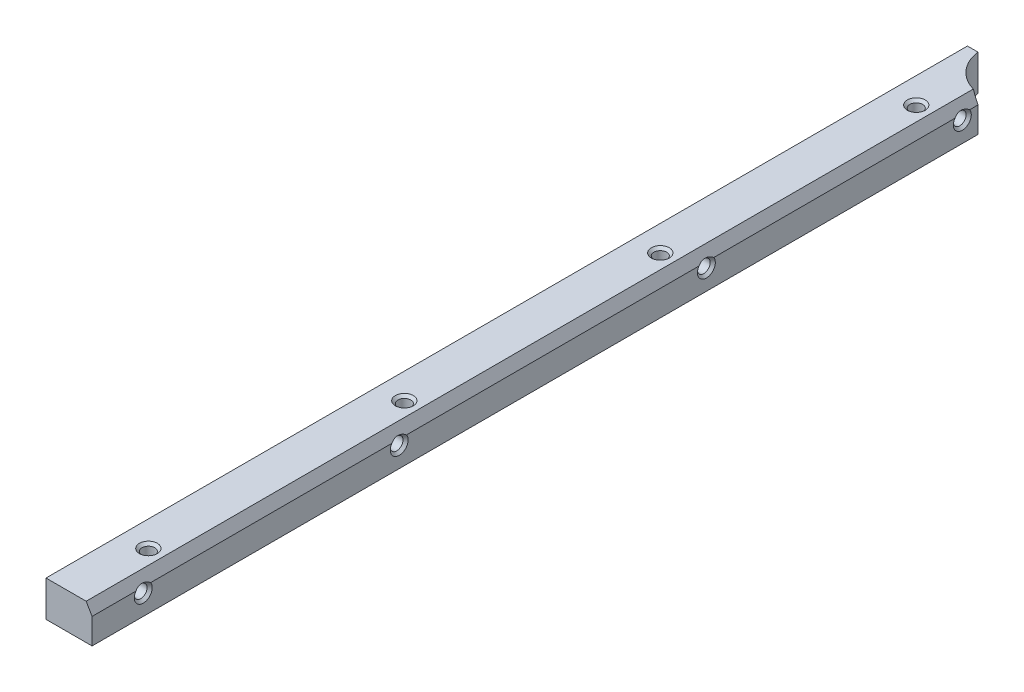
ISO-10303-21;
HEADER;
FILE_DESCRIPTION(('STEP AP214'),'2;1');
FILE_NAME('part.step','',(''),(''),'','','');
FILE_SCHEMA(('AUTOMOTIVE_DESIGN { 1 0 10303 214 1 1 1 1 }'));
ENDSEC;
DATA;
#1=APPLICATION_CONTEXT('core data for automotive mechanical design processes');
#2=APPLICATION_PROTOCOL_DEFINITION('international standard','automotive_design',2000,#1);
#3=PRODUCT_CONTEXT('',#1,'mechanical');
#4=PRODUCT('Part','Part','',(#3));
#5=PRODUCT_RELATED_PRODUCT_CATEGORY('part','',(#4));
#6=PRODUCT_DEFINITION_FORMATION('','',#4);
#7=PRODUCT_DEFINITION_CONTEXT('part definition',#1,'design');
#8=PRODUCT_DEFINITION('design','',#6,#7);
#9=PRODUCT_DEFINITION_SHAPE('','',#8);
#10=(LENGTH_UNIT() NAMED_UNIT(*) SI_UNIT(.MILLI.,.METRE.));
#11=(NAMED_UNIT(*) PLANE_ANGLE_UNIT() SI_UNIT($,.RADIAN.));
#12=(NAMED_UNIT(*) SI_UNIT($,.STERADIAN.) SOLID_ANGLE_UNIT());
#13=UNCERTAINTY_MEASURE_WITH_UNIT(LENGTH_MEASURE(1.E-05),#10,'distance_accuracy_value','');
#14=(GEOMETRIC_REPRESENTATION_CONTEXT(3) GLOBAL_UNCERTAINTY_ASSIGNED_CONTEXT((#13)) GLOBAL_UNIT_ASSIGNED_CONTEXT((#10,
#11,#12)) REPRESENTATION_CONTEXT('',''));
#15=CARTESIAN_POINT('',(0.,0.,0.));
#16=DIRECTION('',(0.,0.,1.));
#17=DIRECTION('',(1.,0.,0.));
#18=AXIS2_PLACEMENT_3D('',#15,#16,#17);
#19=CARTESIAN_POINT('',(0.,0.,180.));
#20=DIRECTION('',(1.,0.,0.));
#21=DIRECTION('',(0.,0.,-1.));
#22=AXIS2_PLACEMENT_3D('',#19,#20,#21);
#23=PLANE('',#22);
#24=CARTESIAN_POINT('',(0.,4.,10.));
#25=DIRECTION('',(-1.,0.,0.));
#26=DIRECTION('',(0.,0.,1.));
#27=AXIS2_PLACEMENT_3D('',#24,#25,#26);
#28=CIRCLE('',#27,1.75);
#29=CARTESIAN_POINT('',(0.,4.,11.75));
#30=VERTEX_POINT('',#29);
#31=EDGE_CURVE('E112',#30,#30,#28,.T.);
#32=ORIENTED_EDGE('',*,*,#31,.F.);
#33=EDGE_LOOP('',(#32));
#34=FACE_BOUND('',#33,.T.);
#35=CARTESIAN_POINT('',(0.,4.,60.));
#36=DIRECTION('',(-1.,0.,0.));
#37=DIRECTION('',(0.,0.,1.));
#38=AXIS2_PLACEMENT_3D('',#35,#36,#37);
#39=CIRCLE('',#38,1.75);
#40=CARTESIAN_POINT('',(0.,4.,61.75));
#41=VERTEX_POINT('',#40);
#42=EDGE_CURVE('E135',#41,#41,#39,.T.);
#43=ORIENTED_EDGE('',*,*,#42,.F.);
#44=EDGE_LOOP('',(#43));
#45=FACE_BOUND('',#44,.T.);
#46=CARTESIAN_POINT('',(0.,4.,120.));
#47=DIRECTION('',(-1.,0.,0.));
#48=DIRECTION('',(0.,0.,1.));
#49=AXIS2_PLACEMENT_3D('',#46,#47,#48);
#50=CIRCLE('',#49,1.75);
#51=CARTESIAN_POINT('',(0.,4.,121.75));
#52=VERTEX_POINT('',#51);
#53=EDGE_CURVE('E147',#52,#52,#50,.T.);
#54=ORIENTED_EDGE('',*,*,#53,.F.);
#55=EDGE_LOOP('',(#54));
#56=FACE_BOUND('',#55,.T.);
#57=CARTESIAN_POINT('',(0.,4.,170.));
#58=DIRECTION('',(-1.,0.,0.));
#59=DIRECTION('',(0.,0.,1.));
#60=AXIS2_PLACEMENT_3D('',#57,#58,#59);
#61=CIRCLE('',#60,1.75);
#62=CARTESIAN_POINT('',(0.,4.,171.75));
#63=VERTEX_POINT('',#62);
#64=EDGE_CURVE('E165',#63,#63,#61,.T.);
#65=ORIENTED_EDGE('',*,*,#64,.F.);
#66=EDGE_LOOP('',(#65));
#67=FACE_BOUND('',#66,.T.);
#68=DIRECTION('',(0.,-1.,0.));
#69=VECTOR('',#68,1.);
#70=CARTESIAN_POINT('',(0.,0.,0.));
#71=LINE('',#70,#69);
#72=CARTESIAN_POINT('',(0.,7.,0.));
#73=VERTEX_POINT('',#72);
#74=CARTESIAN_POINT('',(0.,0.,0.));
#75=VERTEX_POINT('',#74);
#76=EDGE_CURVE('E228',#73,#75,#71,.T.);
#77=ORIENTED_EDGE('',*,*,#76,.T.);
#78=DIRECTION('',(0.,0.,-1.));
#79=VECTOR('',#78,1.);
#80=CARTESIAN_POINT('',(0.,0.,180.));
#81=LINE('',#80,#79);
#82=CARTESIAN_POINT('',(0.,0.,180.));
#83=VERTEX_POINT('',#82);
#84=EDGE_CURVE('E252',#83,#75,#81,.T.);
#85=ORIENTED_EDGE('',*,*,#84,.F.);
#86=DIRECTION('',(0.,-1.,0.));
#87=VECTOR('',#86,1.);
#88=CARTESIAN_POINT('',(0.,0.,180.));
#89=LINE('',#88,#87);
#90=CARTESIAN_POINT('',(0.,7.,180.));
#91=VERTEX_POINT('',#90);
#92=EDGE_CURVE('E229',#91,#83,#89,.T.);
#93=ORIENTED_EDGE('',*,*,#92,.F.);
#94=DIRECTION('',(0.,0.,-1.));
#95=VECTOR('',#94,1.);
#96=CARTESIAN_POINT('',(0.,7.,180.));
#97=LINE('',#96,#95);
#98=EDGE_CURVE('E240',#91,#73,#97,.T.);
#99=ORIENTED_EDGE('',*,*,#98,.T.);
#100=EDGE_LOOP('',(#77,#85,#93,#99));
#101=FACE_BOUND('',#100,.T.);
#102=ADVANCED_FACE('F30',(#34,#45,#56,#67,#101),#23,.F.);
#103=CARTESIAN_POINT('',(0.,0.,180.));
#104=DIRECTION('',(0.,1.,0.));
#105=DIRECTION('',(0.,0.,1.));
#106=AXIS2_PLACEMENT_3D('',#103,#104,#105);
#107=PLANE('',#106);
#108=CARTESIAN_POINT('',(5.,0.,15.));
#109=DIRECTION('',(0.,-1.,0.));
#110=DIRECTION('',(0.,0.,-1.));
#111=AXIS2_PLACEMENT_3D('',#108,#109,#110);
#112=CIRCLE('',#111,1.75);
#113=CARTESIAN_POINT('',(5.,0.,13.25));
#114=VERTEX_POINT('',#113);
#115=EDGE_CURVE('E177',#114,#114,#112,.T.);
#116=ORIENTED_EDGE('',*,*,#115,.F.);
#117=EDGE_LOOP('',(#116));
#118=FACE_BOUND('',#117,.T.);
#119=CARTESIAN_POINT('',(5.,0.,65.));
#120=DIRECTION('',(0.,-1.,0.));
#121=DIRECTION('',(0.,0.,-1.));
#122=AXIS2_PLACEMENT_3D('',#119,#120,#121);
#123=CIRCLE('',#122,1.75);
#124=CARTESIAN_POINT('',(5.,0.,63.25));
#125=VERTEX_POINT('',#124);
#126=EDGE_CURVE('E189',#125,#125,#123,.T.);
#127=ORIENTED_EDGE('',*,*,#126,.F.);
#128=EDGE_LOOP('',(#127));
#129=FACE_BOUND('',#128,.T.);
#130=CARTESIAN_POINT('',(5.,0.,115.));
#131=DIRECTION('',(0.,-1.,0.));
#132=DIRECTION('',(0.,0.,-1.));
#133=AXIS2_PLACEMENT_3D('',#130,#131,#132);
#134=CIRCLE('',#133,1.75);
#135=CARTESIAN_POINT('',(5.,0.,113.25));
#136=VERTEX_POINT('',#135);
#137=EDGE_CURVE('E201',#136,#136,#134,.T.);
#138=ORIENTED_EDGE('',*,*,#137,.F.);
#139=EDGE_LOOP('',(#138));
#140=FACE_BOUND('',#139,.T.);
#141=CARTESIAN_POINT('',(5.,0.,165.));
#142=DIRECTION('',(0.,-1.,0.));
#143=DIRECTION('',(0.,0.,-1.));
#144=AXIS2_PLACEMENT_3D('',#141,#142,#143);
#145=CIRCLE('',#144,1.75);
#146=CARTESIAN_POINT('',(5.,0.,163.25));
#147=VERTEX_POINT('',#146);
#148=EDGE_CURVE('E213',#147,#147,#145,.T.);
#149=ORIENTED_EDGE('',*,*,#148,.F.);
#150=EDGE_LOOP('',(#149));
#151=FACE_BOUND('',#150,.T.);
#152=DIRECTION('',(1.,0.,0.));
#153=VECTOR('',#152,1.);
#154=CARTESIAN_POINT('',(0.,0.,0.));
#155=LINE('',#154,#153);
#156=CARTESIAN_POINT('',(2.06274606680623,0.,0.));
#157=VERTEX_POINT('',#156);
#158=EDGE_CURVE('E243',#75,#157,#155,.T.);
#159=ORIENTED_EDGE('',*,*,#158,.T.);
#160=CARTESIAN_POINT('',(10.,0.,-1.));
#161=DIRECTION('',(0.,1.,0.));
#162=DIRECTION('',(0.,0.,1.));
#163=AXIS2_PLACEMENT_3D('',#160,#161,#162);
#164=CIRCLE('',#163,8.);
#165=CARTESIAN_POINT('',(9.,0.,6.93725393319383));
#166=VERTEX_POINT('',#165);
#167=EDGE_CURVE('E226',#157,#166,#164,.T.);
#168=ORIENTED_EDGE('',*,*,#167,.T.);
#169=DIRECTION('',(0.,0.,-1.));
#170=VECTOR('',#169,1.);
#171=CARTESIAN_POINT('',(9.,0.,180.));
#172=LINE('',#171,#170);
#173=CARTESIAN_POINT('',(9.,0.,180.));
#174=VERTEX_POINT('',#173);
#175=EDGE_CURVE('E249',#174,#166,#172,.T.);
#176=ORIENTED_EDGE('',*,*,#175,.F.);
#177=DIRECTION('',(1.,0.,0.));
#178=VECTOR('',#177,1.);
#179=CARTESIAN_POINT('',(0.,0.,180.));
#180=LINE('',#179,#178);
#181=EDGE_CURVE('E232',#83,#174,#180,.T.);
#182=ORIENTED_EDGE('',*,*,#181,.F.);
#183=ORIENTED_EDGE('',*,*,#84,.T.);
#184=EDGE_LOOP('',(#159,#168,#176,#182,#183));
#185=FACE_BOUND('',#184,.T.);
#186=ADVANCED_FACE('F274',(#118,#129,#140,#151,#185),#107,.F.);
#187=CARTESIAN_POINT('',(9.,0.,180.));
#188=DIRECTION('',(-1.,0.,0.));
#189=DIRECTION('',(0.,0.,1.));
#190=AXIS2_PLACEMENT_3D('',#187,#188,#189);
#191=PLANE('',#190);
#192=DIRECTION('',(0.,0.,1.));
#193=VECTOR('',#192,1.);
#194=CARTESIAN_POINT('',(9.,5.,180.));
#195=LINE('',#194,#193);
#196=CARTESIAN_POINT('',(9.,5.,6.93725393319377));
#197=VERTEX_POINT('',#196);
#198=CARTESIAN_POINT('',(9.,5.,8.56385933836554));
#199=VERTEX_POINT('',#198);
#200=EDGE_CURVE('E111',#197,#199,#195,.T.);
#201=ORIENTED_EDGE('',*,*,#200,.T.);
#202=CARTESIAN_POINT('',(9.,4.,10.));
#203=DIRECTION('',(-1.,0.,0.));
#204=DIRECTION('',(0.,0.,1.));
#205=AXIS2_PLACEMENT_3D('',#202,#203,#204);
#206=CIRCLE('',#205,1.75);
#207=CARTESIAN_POINT('',(9.,5.,11.4361406616345));
#208=VERTEX_POINT('',#207);
#209=EDGE_CURVE('E43',#199,#208,#206,.T.);
#210=ORIENTED_EDGE('',*,*,#209,.T.);
#211=CARTESIAN_POINT('',(9.,5.,58.5638593383655));
#212=VERTEX_POINT('',#211);
#213=EDGE_CURVE('E50',#208,#212,#195,.T.);
#214=ORIENTED_EDGE('',*,*,#213,.T.);
#215=CARTESIAN_POINT('',(9.,4.,60.));
#216=DIRECTION('',(-1.,0.,0.));
#217=DIRECTION('',(0.,0.,1.));
#218=AXIS2_PLACEMENT_3D('',#215,#216,#217);
#219=CIRCLE('',#218,1.75);
#220=CARTESIAN_POINT('',(9.,5.,61.4361406616345));
#221=VERTEX_POINT('',#220);
#222=EDGE_CURVE('E132',#212,#221,#219,.T.);
#223=ORIENTED_EDGE('',*,*,#222,.T.);
#224=CARTESIAN_POINT('',(9.,5.,118.563859338366));
#225=VERTEX_POINT('',#224);
#226=EDGE_CURVE('E116',#221,#225,#195,.T.);
#227=ORIENTED_EDGE('',*,*,#226,.T.);
#228=CARTESIAN_POINT('',(9.,4.,120.));
#229=DIRECTION('',(-1.,0.,0.));
#230=DIRECTION('',(0.,0.,1.));
#231=AXIS2_PLACEMENT_3D('',#228,#229,#230);
#232=CIRCLE('',#231,1.75);
#233=CARTESIAN_POINT('',(9.,5.,121.436140661635));
#234=VERTEX_POINT('',#233);
#235=EDGE_CURVE('E144',#225,#234,#232,.T.);
#236=ORIENTED_EDGE('',*,*,#235,.T.);
#237=CARTESIAN_POINT('',(9.,5.,168.563859338366));
#238=VERTEX_POINT('',#237);
#239=EDGE_CURVE('E120',#234,#238,#195,.T.);
#240=ORIENTED_EDGE('',*,*,#239,.T.);
#241=CARTESIAN_POINT('',(9.,4.,170.));
#242=DIRECTION('',(-1.,0.,0.));
#243=DIRECTION('',(0.,0.,1.));
#244=AXIS2_PLACEMENT_3D('',#241,#242,#243);
#245=CIRCLE('',#244,1.75);
#246=CARTESIAN_POINT('',(9.,5.,171.436140661635));
#247=VERTEX_POINT('',#246);
#248=EDGE_CURVE('E163',#238,#247,#245,.T.);
#249=ORIENTED_EDGE('',*,*,#248,.T.);
#250=CARTESIAN_POINT('',(9.,4.99999999999999,180.));
#251=VERTEX_POINT('',#250);
#252=EDGE_CURVE('E119',#247,#251,#195,.T.);
#253=ORIENTED_EDGE('',*,*,#252,.T.);
#254=DIRECTION('',(0.,1.,0.));
#255=VECTOR('',#254,1.);
#256=CARTESIAN_POINT('',(9.,0.,180.));
#257=LINE('',#256,#255);
#258=EDGE_CURVE('E235',#174,#251,#257,.T.);
#259=ORIENTED_EDGE('',*,*,#258,.F.);
#260=ORIENTED_EDGE('',*,*,#175,.T.);
#261=DIRECTION('',(0.,1.,0.));
#262=VECTOR('',#261,1.);
#263=CARTESIAN_POINT('',(9.,-225.450937012912,6.93725393319377));
#264=LINE('',#263,#262);
#265=EDGE_CURVE('E222',#166,#197,#264,.T.);
#266=ORIENTED_EDGE('',*,*,#265,.T.);
#267=EDGE_LOOP('',(#201,#210,#214,#223,#227,#236,#240,#249,#253,#259,#260,#266));
#268=FACE_BOUND('',#267,.T.);
#269=ADVANCED_FACE('F109',(#268),#191,.F.);
#270=CARTESIAN_POINT('',(0.,7.,180.));
#271=DIRECTION('',(0.,-1.,0.));
#272=DIRECTION('',(0.,0.,-1.));
#273=AXIS2_PLACEMENT_3D('',#270,#271,#272);
#274=PLANE('',#273);
#275=CARTESIAN_POINT('',(5.,7.,15.));
#276=DIRECTION('',(0.,-1.,0.));
#277=DIRECTION('',(0.,0.,-1.));
#278=AXIS2_PLACEMENT_3D('',#275,#276,#277);
#279=CIRCLE('',#278,1.75);
#280=CARTESIAN_POINT('',(5.,7.,13.25));
#281=VERTEX_POINT('',#280);
#282=EDGE_CURVE('E174',#281,#281,#279,.T.);
#283=ORIENTED_EDGE('',*,*,#282,.T.);
#284=EDGE_LOOP('',(#283));
#285=FACE_BOUND('',#284,.T.);
#286=CARTESIAN_POINT('',(5.,7.,65.));
#287=DIRECTION('',(0.,-1.,0.));
#288=DIRECTION('',(0.,0.,-1.));
#289=AXIS2_PLACEMENT_3D('',#286,#287,#288);
#290=CIRCLE('',#289,1.75);
#291=CARTESIAN_POINT('',(5.,7.,63.25));
#292=VERTEX_POINT('',#291);
#293=EDGE_CURVE('E186',#292,#292,#290,.T.);
#294=ORIENTED_EDGE('',*,*,#293,.T.);
#295=EDGE_LOOP('',(#294));
#296=FACE_BOUND('',#295,.T.);
#297=CARTESIAN_POINT('',(5.,7.,115.));
#298=DIRECTION('',(0.,-1.,0.));
#299=DIRECTION('',(0.,0.,-1.));
#300=AXIS2_PLACEMENT_3D('',#297,#298,#299);
#301=CIRCLE('',#300,1.75);
#302=CARTESIAN_POINT('',(5.,7.,113.25));
#303=VERTEX_POINT('',#302);
#304=EDGE_CURVE('E198',#303,#303,#301,.T.);
#305=ORIENTED_EDGE('',*,*,#304,.T.);
#306=EDGE_LOOP('',(#305));
#307=FACE_BOUND('',#306,.T.);
#308=CARTESIAN_POINT('',(5.,7.,165.));
#309=DIRECTION('',(0.,-1.,0.));
#310=DIRECTION('',(0.,0.,-1.));
#311=AXIS2_PLACEMENT_3D('',#308,#309,#310);
#312=CIRCLE('',#311,1.75);
#313=CARTESIAN_POINT('',(5.,7.,163.25));
#314=VERTEX_POINT('',#313);
#315=EDGE_CURVE('E210',#314,#314,#312,.T.);
#316=ORIENTED_EDGE('',*,*,#315,.T.);
#317=EDGE_LOOP('',(#316));
#318=FACE_BOUND('',#317,.T.);
#319=DIRECTION('',(-1.,0.,0.));
#320=VECTOR('',#319,1.);
#321=CARTESIAN_POINT('',(0.,7.,180.));
#322=LINE('',#321,#320);
#323=CARTESIAN_POINT('',(7.84529946162074,7.,180.));
#324=VERTEX_POINT('',#323);
#325=EDGE_CURVE('E238',#324,#91,#322,.T.);
#326=ORIENTED_EDGE('',*,*,#325,.F.);
#327=DIRECTION('',(0.,0.,-1.));
#328=VECTOR('',#327,1.);
#329=CARTESIAN_POINT('',(7.84529946162074,7.,180.));
#330=LINE('',#329,#328);
#331=CARTESIAN_POINT('',(7.84529946162074,7.00000000000001,6.70436665728651));
#332=VERTEX_POINT('',#331);
#333=EDGE_CURVE('E257',#324,#332,#330,.T.);
#334=ORIENTED_EDGE('',*,*,#333,.T.);
#335=CARTESIAN_POINT('',(10.,7.00000000000001,-1.));
#336=DIRECTION('',(0.,-1.,0.));
#337=DIRECTION('',(0.,0.,-1.));
#338=AXIS2_PLACEMENT_3D('',#335,#336,#337);
#339=CIRCLE('',#338,8.);
#340=CARTESIAN_POINT('',(2.06274606680623,7.00000000000001,0.));
#341=VERTEX_POINT('',#340);
#342=EDGE_CURVE('E224',#332,#341,#339,.T.);
#343=ORIENTED_EDGE('',*,*,#342,.T.);
#344=DIRECTION('',(-1.,0.,0.));
#345=VECTOR('',#344,1.);
#346=CARTESIAN_POINT('',(0.,7.,0.));
#347=LINE('',#346,#345);
#348=EDGE_CURVE('E233',#341,#73,#347,.T.);
#349=ORIENTED_EDGE('',*,*,#348,.T.);
#350=ORIENTED_EDGE('',*,*,#98,.F.);
#351=EDGE_LOOP('',(#326,#334,#343,#349,#350));
#352=FACE_BOUND('',#351,.T.);
#353=ADVANCED_FACE('F283',(#285,#296,#307,#318,#352),#274,.F.);
#354=CARTESIAN_POINT('',(0.,7.,180.));
#355=DIRECTION('',(0.,0.,-1.));
#356=DIRECTION('',(-1.,0.,0.));
#357=AXIS2_PLACEMENT_3D('',#354,#355,#356);
#358=PLANE('',#357);
#359=ORIENTED_EDGE('',*,*,#258,.T.);
#360=DIRECTION('',(0.500000000000001,-0.866025403784438,0.));
#361=VECTOR('',#360,1.);
#362=CARTESIAN_POINT('',(7.84529946162074,7.,180.));
#363=LINE('',#362,#361);
#364=EDGE_CURVE('E118',#251,#324,#363,.F.);
#365=ORIENTED_EDGE('',*,*,#364,.T.);
#366=ORIENTED_EDGE('',*,*,#325,.T.);
#367=ORIENTED_EDGE('',*,*,#92,.T.);
#368=ORIENTED_EDGE('',*,*,#181,.T.);
#369=EDGE_LOOP('',(#359,#365,#366,#367,#368));
#370=FACE_BOUND('',#369,.T.);
#371=ADVANCED_FACE('F269',(#370),#358,.F.);
#372=CARTESIAN_POINT('',(0.,7.,0.));
#373=DIRECTION('',(0.,0.,-1.));
#374=DIRECTION('',(-1.,0.,0.));
#375=AXIS2_PLACEMENT_3D('',#372,#373,#374);
#376=PLANE('',#375);
#377=DIRECTION('',(0.,1.,0.));
#378=VECTOR('',#377,1.);
#379=CARTESIAN_POINT('',(2.06274606680623,-225.450937012912,0.));
#380=LINE('',#379,#378);
#381=EDGE_CURVE('E255',#157,#341,#380,.T.);
#382=ORIENTED_EDGE('',*,*,#381,.F.);
#383=ORIENTED_EDGE('',*,*,#158,.F.);
#384=ORIENTED_EDGE('',*,*,#76,.F.);
#385=ORIENTED_EDGE('',*,*,#348,.F.);
#386=EDGE_LOOP('',(#382,#383,#384,#385));
#387=FACE_BOUND('',#386,.T.);
#388=ADVANCED_FACE('F279',(#387),#376,.T.);
#389=CARTESIAN_POINT('',(10.,-225.450937012912,-1.));
#390=DIRECTION('',(0.,1.,0.));
#391=DIRECTION('',(0.,0.,1.));
#392=AXIS2_PLACEMENT_3D('',#389,#390,#391);
#393=CYLINDRICAL_SURFACE('',#392,8.);
#394=ORIENTED_EDGE('',*,*,#342,.F.);
#395=CARTESIAN_POINT('',(10.,3.26794919243112,-1.));
#396=DIRECTION('',(-0.866025403784438,-0.5,0.));
#397=DIRECTION('',(-0.500000000000001,0.866025403784438,0.));
#398=AXIS2_PLACEMENT_3D('',#395,#396,#397);
#399=ELLIPSE('',#398,16.,8.);
#400=EDGE_CURVE('E123',#332,#197,#399,.F.);
#401=ORIENTED_EDGE('',*,*,#400,.T.);
#402=ORIENTED_EDGE('',*,*,#265,.F.);
#403=ORIENTED_EDGE('',*,*,#167,.F.);
#404=ORIENTED_EDGE('',*,*,#381,.T.);
#405=EDGE_LOOP('',(#394,#401,#402,#403,#404));
#406=FACE_BOUND('',#405,.T.);
#407=ADVANCED_FACE('F276',(#406),#393,.F.);
#408=CARTESIAN_POINT('',(7.84529946162074,7.,180.));
#409=DIRECTION('',(-0.866025403784438,-0.5,0.));
#410=DIRECTION('',(0.500000000000001,-0.866025403784438,0.));
#411=AXIS2_PLACEMENT_3D('',#408,#409,#410);
#412=PLANE('',#411);
#413=CARTESIAN_POINT('',(10.7410254037844,1.98445554337723,10.));
#414=DIRECTION('',(-0.866025403784438,-0.5,0.));
#415=DIRECTION('',(0.5,-0.866025403784438,0.));
#416=AXIS2_PLACEMENT_3D('',#413,#414,#415);
#417=ELLIPSE('',#416,4.03108891324553,2.85041030612183);
#418=EDGE_CURVE('E11',#199,#208,#417,.F.);
#419=ORIENTED_EDGE('',*,*,#418,.F.);
#420=ORIENTED_EDGE('',*,*,#200,.F.);
#421=ORIENTED_EDGE('',*,*,#400,.F.);
#422=ORIENTED_EDGE('',*,*,#333,.F.);
#423=ORIENTED_EDGE('',*,*,#364,.F.);
#424=ORIENTED_EDGE('',*,*,#252,.F.);
#425=CARTESIAN_POINT('',(10.7410254037844,1.98445554337723,170.));
#426=DIRECTION('',(-0.866025403784438,-0.5,0.));
#427=DIRECTION('',(0.5,-0.866025403784438,0.));
#428=AXIS2_PLACEMENT_3D('',#425,#426,#427);
#429=ELLIPSE('',#428,4.03108891324553,2.85041030612183);
#430=EDGE_CURVE('E126',#238,#247,#429,.F.);
#431=ORIENTED_EDGE('',*,*,#430,.F.);
#432=ORIENTED_EDGE('',*,*,#239,.F.);
#433=CARTESIAN_POINT('',(10.7410254037844,1.98445554337723,120.));
#434=DIRECTION('',(-0.866025403784438,-0.5,0.));
#435=DIRECTION('',(0.5,-0.866025403784438,0.));
#436=AXIS2_PLACEMENT_3D('',#433,#434,#435);
#437=ELLIPSE('',#436,4.03108891324553,2.85041030612183);
#438=EDGE_CURVE('E128',#225,#234,#437,.F.);
#439=ORIENTED_EDGE('',*,*,#438,.F.);
#440=ORIENTED_EDGE('',*,*,#226,.F.);
#441=CARTESIAN_POINT('',(10.7410254037844,1.98445554337723,60.));
#442=DIRECTION('',(-0.866025403784438,-0.5,0.));
#443=DIRECTION('',(0.5,-0.866025403784438,0.));
#444=AXIS2_PLACEMENT_3D('',#441,#442,#443);
#445=ELLIPSE('',#444,4.03108891324553,2.85041030612183);
#446=EDGE_CURVE('E38',#212,#221,#445,.F.);
#447=ORIENTED_EDGE('',*,*,#446,.F.);
#448=ORIENTED_EDGE('',*,*,#213,.F.);
#449=EDGE_LOOP('',(#419,#420,#421,#422,#423,#424,#431,#432,#439,#440,#447,#448));
#450=FACE_BOUND('',#449,.T.);
#451=ADVANCED_FACE('F32',(#450),#412,.F.);
#452=CARTESIAN_POINT('',(5.,6.5,165.));
#453=DIRECTION('',(0.,1.,0.));
#454=DIRECTION('',(0.,0.,1.));
#455=AXIS2_PLACEMENT_3D('',#452,#453,#454);
#456=CONICAL_SURFACE('',#455,1.25,0.785398163397448);
#457=ORIENTED_EDGE('',*,*,#315,.F.);
#458=EDGE_LOOP('',(#457));
#459=FACE_BOUND('',#458,.T.);
#460=CARTESIAN_POINT('',(5.,6.5,165.));
#461=DIRECTION('',(0.,-1.,0.));
#462=DIRECTION('',(0.,0.,-1.));
#463=AXIS2_PLACEMENT_3D('',#460,#461,#462);
#464=CIRCLE('',#463,1.25);
#465=CARTESIAN_POINT('',(5.,6.5,163.75));
#466=VERTEX_POINT('',#465);
#467=EDGE_CURVE('E219',#466,#466,#464,.T.);
#468=ORIENTED_EDGE('',*,*,#467,.T.);
#469=EDGE_LOOP('',(#468));
#470=FACE_BOUND('',#469,.T.);
#471=ADVANCED_FACE('F375',(#459,#470),#456,.F.);
#472=CARTESIAN_POINT('',(5.,0.,165.));
#473=DIRECTION('',(0.,-1.,0.));
#474=DIRECTION('',(0.,0.,-1.));
#475=AXIS2_PLACEMENT_3D('',#472,#473,#474);
#476=CYLINDRICAL_SURFACE('',#475,1.24999999999999);
#477=ORIENTED_EDGE('',*,*,#467,.F.);
#478=EDGE_LOOP('',(#477));
#479=FACE_BOUND('',#478,.T.);
#480=CARTESIAN_POINT('',(5.,0.500000000000028,165.));
#481=DIRECTION('',(0.,-1.,0.));
#482=DIRECTION('',(0.,0.,-1.));
#483=AXIS2_PLACEMENT_3D('',#480,#481,#482);
#484=CIRCLE('',#483,1.24999999999999);
#485=CARTESIAN_POINT('',(5.,0.500000000000028,163.75));
#486=VERTEX_POINT('',#485);
#487=EDGE_CURVE('E216',#486,#486,#484,.T.);
#488=ORIENTED_EDGE('',*,*,#487,.T.);
#489=EDGE_LOOP('',(#488));
#490=FACE_BOUND('',#489,.T.);
#491=ADVANCED_FACE('F371',(#479,#490),#476,.F.);
#492=CARTESIAN_POINT('',(5.,0.,165.));
#493=DIRECTION('',(0.,-1.,0.));
#494=DIRECTION('',(0.,0.,-1.));
#495=AXIS2_PLACEMENT_3D('',#492,#493,#494);
#496=CONICAL_SURFACE('',#495,1.75,0.785398163397431);
#497=ORIENTED_EDGE('',*,*,#487,.F.);
#498=EDGE_LOOP('',(#497));
#499=FACE_BOUND('',#498,.T.);
#500=ORIENTED_EDGE('',*,*,#148,.T.);
#501=EDGE_LOOP('',(#500));
#502=FACE_BOUND('',#501,.T.);
#503=ADVANCED_FACE('F367',(#499,#502),#496,.F.);
#504=CARTESIAN_POINT('',(5.,6.5,115.));
#505=DIRECTION('',(0.,1.,0.));
#506=DIRECTION('',(0.,0.,1.));
#507=AXIS2_PLACEMENT_3D('',#504,#505,#506);
#508=CONICAL_SURFACE('',#507,1.25,0.785398163397448);
#509=ORIENTED_EDGE('',*,*,#304,.F.);
#510=EDGE_LOOP('',(#509));
#511=FACE_BOUND('',#510,.T.);
#512=CARTESIAN_POINT('',(5.,6.5,115.));
#513=DIRECTION('',(0.,-1.,0.));
#514=DIRECTION('',(0.,0.,-1.));
#515=AXIS2_PLACEMENT_3D('',#512,#513,#514);
#516=CIRCLE('',#515,1.25);
#517=CARTESIAN_POINT('',(5.,6.5,113.75));
#518=VERTEX_POINT('',#517);
#519=EDGE_CURVE('E207',#518,#518,#516,.T.);
#520=ORIENTED_EDGE('',*,*,#519,.T.);
#521=EDGE_LOOP('',(#520));
#522=FACE_BOUND('',#521,.T.);
#523=ADVANCED_FACE('F363',(#511,#522),#508,.F.);
#524=CARTESIAN_POINT('',(5.,0.,115.));
#525=DIRECTION('',(0.,-1.,0.));
#526=DIRECTION('',(0.,0.,-1.));
#527=AXIS2_PLACEMENT_3D('',#524,#525,#526);
#528=CYLINDRICAL_SURFACE('',#527,1.24999999999999);
#529=ORIENTED_EDGE('',*,*,#519,.F.);
#530=EDGE_LOOP('',(#529));
#531=FACE_BOUND('',#530,.T.);
#532=CARTESIAN_POINT('',(5.,0.500000000000028,115.));
#533=DIRECTION('',(0.,-1.,0.));
#534=DIRECTION('',(0.,0.,-1.));
#535=AXIS2_PLACEMENT_3D('',#532,#533,#534);
#536=CIRCLE('',#535,1.24999999999999);
#537=CARTESIAN_POINT('',(5.,0.500000000000028,113.75));
#538=VERTEX_POINT('',#537);
#539=EDGE_CURVE('E204',#538,#538,#536,.T.);
#540=ORIENTED_EDGE('',*,*,#539,.T.);
#541=EDGE_LOOP('',(#540));
#542=FACE_BOUND('',#541,.T.);
#543=ADVANCED_FACE('F359',(#531,#542),#528,.F.);
#544=CARTESIAN_POINT('',(5.,0.,115.));
#545=DIRECTION('',(0.,-1.,0.));
#546=DIRECTION('',(0.,0.,-1.));
#547=AXIS2_PLACEMENT_3D('',#544,#545,#546);
#548=CONICAL_SURFACE('',#547,1.75,0.785398163397431);
#549=ORIENTED_EDGE('',*,*,#539,.F.);
#550=EDGE_LOOP('',(#549));
#551=FACE_BOUND('',#550,.T.);
#552=ORIENTED_EDGE('',*,*,#137,.T.);
#553=EDGE_LOOP('',(#552));
#554=FACE_BOUND('',#553,.T.);
#555=ADVANCED_FACE('F355',(#551,#554),#548,.F.);
#556=CARTESIAN_POINT('',(5.,6.5,65.));
#557=DIRECTION('',(0.,1.,0.));
#558=DIRECTION('',(0.,0.,1.));
#559=AXIS2_PLACEMENT_3D('',#556,#557,#558);
#560=CONICAL_SURFACE('',#559,1.25,0.785398163397448);
#561=ORIENTED_EDGE('',*,*,#293,.F.);
#562=EDGE_LOOP('',(#561));
#563=FACE_BOUND('',#562,.T.);
#564=CARTESIAN_POINT('',(5.,6.5,65.));
#565=DIRECTION('',(0.,-1.,0.));
#566=DIRECTION('',(0.,0.,-1.));
#567=AXIS2_PLACEMENT_3D('',#564,#565,#566);
#568=CIRCLE('',#567,1.25);
#569=CARTESIAN_POINT('',(5.,6.5,63.75));
#570=VERTEX_POINT('',#569);
#571=EDGE_CURVE('E195',#570,#570,#568,.T.);
#572=ORIENTED_EDGE('',*,*,#571,.T.);
#573=EDGE_LOOP('',(#572));
#574=FACE_BOUND('',#573,.T.);
#575=ADVANCED_FACE('F351',(#563,#574),#560,.F.);
#576=CARTESIAN_POINT('',(5.,0.,65.));
#577=DIRECTION('',(0.,-1.,0.));
#578=DIRECTION('',(0.,0.,-1.));
#579=AXIS2_PLACEMENT_3D('',#576,#577,#578);
#580=CYLINDRICAL_SURFACE('',#579,1.24999999999999);
#581=ORIENTED_EDGE('',*,*,#571,.F.);
#582=EDGE_LOOP('',(#581));
#583=FACE_BOUND('',#582,.T.);
#584=CARTESIAN_POINT('',(5.,0.500000000000028,65.));
#585=DIRECTION('',(0.,-1.,0.));
#586=DIRECTION('',(0.,0.,-1.));
#587=AXIS2_PLACEMENT_3D('',#584,#585,#586);
#588=CIRCLE('',#587,1.24999999999999);
#589=CARTESIAN_POINT('',(5.,0.500000000000028,63.75));
#590=VERTEX_POINT('',#589);
#591=EDGE_CURVE('E192',#590,#590,#588,.T.);
#592=ORIENTED_EDGE('',*,*,#591,.T.);
#593=EDGE_LOOP('',(#592));
#594=FACE_BOUND('',#593,.T.);
#595=ADVANCED_FACE('F347',(#583,#594),#580,.F.);
#596=CARTESIAN_POINT('',(5.,0.,65.));
#597=DIRECTION('',(0.,-1.,0.));
#598=DIRECTION('',(0.,0.,-1.));
#599=AXIS2_PLACEMENT_3D('',#596,#597,#598);
#600=CONICAL_SURFACE('',#599,1.75,0.785398163397431);
#601=ORIENTED_EDGE('',*,*,#591,.F.);
#602=EDGE_LOOP('',(#601));
#603=FACE_BOUND('',#602,.T.);
#604=ORIENTED_EDGE('',*,*,#126,.T.);
#605=EDGE_LOOP('',(#604));
#606=FACE_BOUND('',#605,.T.);
#607=ADVANCED_FACE('F343',(#603,#606),#600,.F.);
#608=CARTESIAN_POINT('',(5.,6.5,15.));
#609=DIRECTION('',(0.,1.,0.));
#610=DIRECTION('',(0.,0.,1.));
#611=AXIS2_PLACEMENT_3D('',#608,#609,#610);
#612=CONICAL_SURFACE('',#611,1.25,0.785398163397448);
#613=ORIENTED_EDGE('',*,*,#282,.F.);
#614=EDGE_LOOP('',(#613));
#615=FACE_BOUND('',#614,.T.);
#616=CARTESIAN_POINT('',(5.,6.5,15.));
#617=DIRECTION('',(0.,-1.,0.));
#618=DIRECTION('',(0.,0.,-1.));
#619=AXIS2_PLACEMENT_3D('',#616,#617,#618);
#620=CIRCLE('',#619,1.25);
#621=CARTESIAN_POINT('',(5.,6.5,13.75));
#622=VERTEX_POINT('',#621);
#623=EDGE_CURVE('E183',#622,#622,#620,.T.);
#624=ORIENTED_EDGE('',*,*,#623,.T.);
#625=EDGE_LOOP('',(#624));
#626=FACE_BOUND('',#625,.T.);
#627=ADVANCED_FACE('F339',(#615,#626),#612,.F.);
#628=CARTESIAN_POINT('',(5.,0.,15.));
#629=DIRECTION('',(0.,-1.,0.));
#630=DIRECTION('',(0.,0.,-1.));
#631=AXIS2_PLACEMENT_3D('',#628,#629,#630);
#632=CYLINDRICAL_SURFACE('',#631,1.24999999999999);
#633=ORIENTED_EDGE('',*,*,#623,.F.);
#634=EDGE_LOOP('',(#633));
#635=FACE_BOUND('',#634,.T.);
#636=CARTESIAN_POINT('',(5.,0.500000000000028,15.));
#637=DIRECTION('',(0.,-1.,0.));
#638=DIRECTION('',(0.,0.,-1.));
#639=AXIS2_PLACEMENT_3D('',#636,#637,#638);
#640=CIRCLE('',#639,1.24999999999999);
#641=CARTESIAN_POINT('',(5.,0.500000000000028,13.75));
#642=VERTEX_POINT('',#641);
#643=EDGE_CURVE('E180',#642,#642,#640,.T.);
#644=ORIENTED_EDGE('',*,*,#643,.T.);
#645=EDGE_LOOP('',(#644));
#646=FACE_BOUND('',#645,.T.);
#647=ADVANCED_FACE('F335',(#635,#646),#632,.F.);
#648=CARTESIAN_POINT('',(5.,0.,15.));
#649=DIRECTION('',(0.,-1.,0.));
#650=DIRECTION('',(0.,0.,-1.));
#651=AXIS2_PLACEMENT_3D('',#648,#649,#650);
#652=CONICAL_SURFACE('',#651,1.75,0.785398163397431);
#653=ORIENTED_EDGE('',*,*,#643,.F.);
#654=EDGE_LOOP('',(#653));
#655=FACE_BOUND('',#654,.T.);
#656=ORIENTED_EDGE('',*,*,#115,.T.);
#657=EDGE_LOOP('',(#656));
#658=FACE_BOUND('',#657,.T.);
#659=ADVANCED_FACE('F331',(#655,#658),#652,.F.);
#660=CARTESIAN_POINT('',(8.5,4.,170.));
#661=DIRECTION('',(1.,0.,0.));
#662=DIRECTION('',(0.,0.,-1.));
#663=AXIS2_PLACEMENT_3D('',#660,#661,#662);
#664=CONICAL_SURFACE('',#663,1.25,0.785398163397448);
#665=ORIENTED_EDGE('',*,*,#430,.T.);
#666=ORIENTED_EDGE('',*,*,#248,.F.);
#667=EDGE_LOOP('',(#665,#666));
#668=FACE_BOUND('',#667,.T.);
#669=CARTESIAN_POINT('',(8.5,4.,170.));
#670=DIRECTION('',(-1.,0.,0.));
#671=DIRECTION('',(0.,0.,1.));
#672=AXIS2_PLACEMENT_3D('',#669,#670,#671);
#673=CIRCLE('',#672,1.25);
#674=CARTESIAN_POINT('',(8.5,4.,171.25));
#675=VERTEX_POINT('',#674);
#676=EDGE_CURVE('E171',#675,#675,#673,.T.);
#677=ORIENTED_EDGE('',*,*,#676,.T.);
#678=EDGE_LOOP('',(#677));
#679=FACE_BOUND('',#678,.T.);
#680=ADVANCED_FACE('F323',(#668,#679),#664,.F.);
#681=CARTESIAN_POINT('',(0.,4.,170.));
#682=DIRECTION('',(-1.,0.,0.));
#683=DIRECTION('',(0.,0.,1.));
#684=AXIS2_PLACEMENT_3D('',#681,#682,#683);
#685=CYLINDRICAL_SURFACE('',#684,1.24999999999999);
#686=ORIENTED_EDGE('',*,*,#676,.F.);
#687=EDGE_LOOP('',(#686));
#688=FACE_BOUND('',#687,.T.);
#689=CARTESIAN_POINT('',(0.500000000000028,4.,170.));
#690=DIRECTION('',(-1.,0.,0.));
#691=DIRECTION('',(0.,0.,1.));
#692=AXIS2_PLACEMENT_3D('',#689,#690,#691);
#693=CIRCLE('',#692,1.24999999999999);
#694=CARTESIAN_POINT('',(0.500000000000028,4.,171.25));
#695=VERTEX_POINT('',#694);
#696=EDGE_CURVE('E168',#695,#695,#693,.T.);
#697=ORIENTED_EDGE('',*,*,#696,.T.);
#698=EDGE_LOOP('',(#697));
#699=FACE_BOUND('',#698,.T.);
#700=ADVANCED_FACE('F314',(#688,#699),#685,.F.);
#701=CARTESIAN_POINT('',(0.,4.,170.));
#702=DIRECTION('',(-1.,0.,0.));
#703=DIRECTION('',(0.,0.,1.));
#704=AXIS2_PLACEMENT_3D('',#701,#702,#703);
#705=CONICAL_SURFACE('',#704,1.75,0.785398163397431);
#706=ORIENTED_EDGE('',*,*,#696,.F.);
#707=EDGE_LOOP('',(#706));
#708=FACE_BOUND('',#707,.T.);
#709=ORIENTED_EDGE('',*,*,#64,.T.);
#710=EDGE_LOOP('',(#709));
#711=FACE_BOUND('',#710,.T.);
#712=ADVANCED_FACE('F312',(#708,#711),#705,.F.);
#713=CARTESIAN_POINT('',(8.5,4.,120.));
#714=DIRECTION('',(1.,0.,0.));
#715=DIRECTION('',(0.,0.,-1.));
#716=AXIS2_PLACEMENT_3D('',#713,#714,#715);
#717=CONICAL_SURFACE('',#716,1.25,0.785398163397448);
#718=ORIENTED_EDGE('',*,*,#438,.T.);
#719=ORIENTED_EDGE('',*,*,#235,.F.);
#720=EDGE_LOOP('',(#718,#719));
#721=FACE_BOUND('',#720,.T.);
#722=CARTESIAN_POINT('',(8.5,4.,120.));
#723=DIRECTION('',(-1.,0.,0.));
#724=DIRECTION('',(0.,0.,1.));
#725=AXIS2_PLACEMENT_3D('',#722,#723,#724);
#726=CIRCLE('',#725,1.25);
#727=CARTESIAN_POINT('',(8.5,4.,121.25));
#728=VERTEX_POINT('',#727);
#729=EDGE_CURVE('E160',#728,#728,#726,.T.);
#730=ORIENTED_EDGE('',*,*,#729,.T.);
#731=EDGE_LOOP('',(#730));
#732=FACE_BOUND('',#731,.T.);
#733=ADVANCED_FACE('F142',(#721,#732),#717,.F.);
#734=CARTESIAN_POINT('',(0.,4.,120.));
#735=DIRECTION('',(-1.,0.,0.));
#736=DIRECTION('',(0.,0.,1.));
#737=AXIS2_PLACEMENT_3D('',#734,#735,#736);
#738=CYLINDRICAL_SURFACE('',#737,1.24999999999999);
#739=ORIENTED_EDGE('',*,*,#729,.F.);
#740=EDGE_LOOP('',(#739));
#741=FACE_BOUND('',#740,.T.);
#742=CARTESIAN_POINT('',(0.500000000000028,4.,120.));
#743=DIRECTION('',(-1.,0.,0.));
#744=DIRECTION('',(0.,0.,1.));
#745=AXIS2_PLACEMENT_3D('',#742,#743,#744);
#746=CIRCLE('',#745,1.24999999999999);
#747=CARTESIAN_POINT('',(0.500000000000028,4.,121.25));
#748=VERTEX_POINT('',#747);
#749=EDGE_CURVE('E151',#748,#748,#746,.T.);
#750=ORIENTED_EDGE('',*,*,#749,.T.);
#751=EDGE_LOOP('',(#750));
#752=FACE_BOUND('',#751,.T.);
#753=ADVANCED_FACE('F321',(#741,#752),#738,.F.);
#754=CARTESIAN_POINT('',(0.,4.,120.));
#755=DIRECTION('',(-1.,0.,0.));
#756=DIRECTION('',(0.,0.,1.));
#757=AXIS2_PLACEMENT_3D('',#754,#755,#756);
#758=CONICAL_SURFACE('',#757,1.75,0.785398163397431);
#759=ORIENTED_EDGE('',*,*,#749,.F.);
#760=EDGE_LOOP('',(#759));
#761=FACE_BOUND('',#760,.T.);
#762=ORIENTED_EDGE('',*,*,#53,.T.);
#763=EDGE_LOOP('',(#762));
#764=FACE_BOUND('',#763,.T.);
#765=ADVANCED_FACE('F472',(#761,#764),#758,.F.);
#766=CARTESIAN_POINT('',(8.5,4.,60.));
#767=DIRECTION('',(1.,0.,0.));
#768=DIRECTION('',(0.,0.,-1.));
#769=AXIS2_PLACEMENT_3D('',#766,#767,#768);
#770=CONICAL_SURFACE('',#769,1.25,0.785398163397448);
#771=ORIENTED_EDGE('',*,*,#446,.T.);
#772=ORIENTED_EDGE('',*,*,#222,.F.);
#773=EDGE_LOOP('',(#771,#772));
#774=FACE_BOUND('',#773,.T.);
#775=CARTESIAN_POINT('',(8.5,4.,60.));
#776=DIRECTION('',(-1.,0.,0.));
#777=DIRECTION('',(0.,0.,1.));
#778=AXIS2_PLACEMENT_3D('',#775,#776,#777);
#779=CIRCLE('',#778,1.25);
#780=CARTESIAN_POINT('',(8.5,4.,61.25));
#781=VERTEX_POINT('',#780);
#782=EDGE_CURVE('E148',#781,#781,#779,.T.);
#783=ORIENTED_EDGE('',*,*,#782,.T.);
#784=EDGE_LOOP('',(#783));
#785=FACE_BOUND('',#784,.T.);
#786=ADVANCED_FACE('F130',(#774,#785),#770,.F.);
#787=CARTESIAN_POINT('',(0.,4.,60.));
#788=DIRECTION('',(-1.,0.,0.));
#789=DIRECTION('',(0.,0.,1.));
#790=AXIS2_PLACEMENT_3D('',#787,#788,#789);
#791=CYLINDRICAL_SURFACE('',#790,1.24999999999999);
#792=ORIENTED_EDGE('',*,*,#782,.F.);
#793=EDGE_LOOP('',(#792));
#794=FACE_BOUND('',#793,.T.);
#795=CARTESIAN_POINT('',(0.500000000000028,4.,60.));
#796=DIRECTION('',(-1.,0.,0.));
#797=DIRECTION('',(0.,0.,1.));
#798=AXIS2_PLACEMENT_3D('',#795,#796,#797);
#799=CIRCLE('',#798,1.24999999999999);
#800=CARTESIAN_POINT('',(0.500000000000028,4.,61.25));
#801=VERTEX_POINT('',#800);
#802=EDGE_CURVE('E154',#801,#801,#799,.T.);
#803=ORIENTED_EDGE('',*,*,#802,.T.);
#804=EDGE_LOOP('',(#803));
#805=FACE_BOUND('',#804,.T.);
#806=ADVANCED_FACE('F490',(#794,#805),#791,.F.);
#807=CARTESIAN_POINT('',(0.,4.,60.));
#808=DIRECTION('',(-1.,0.,0.));
#809=DIRECTION('',(0.,0.,1.));
#810=AXIS2_PLACEMENT_3D('',#807,#808,#809);
#811=CONICAL_SURFACE('',#810,1.75,0.785398163397431);
#812=ORIENTED_EDGE('',*,*,#802,.F.);
#813=EDGE_LOOP('',(#812));
#814=FACE_BOUND('',#813,.T.);
#815=ORIENTED_EDGE('',*,*,#42,.T.);
#816=EDGE_LOOP('',(#815));
#817=FACE_BOUND('',#816,.T.);
#818=ADVANCED_FACE('F499',(#814,#817),#811,.F.);
#819=CARTESIAN_POINT('',(8.5,4.,10.));
#820=DIRECTION('',(1.,0.,0.));
#821=DIRECTION('',(0.,0.,-1.));
#822=AXIS2_PLACEMENT_3D('',#819,#820,#821);
#823=CONICAL_SURFACE('',#822,1.25,0.785398163397448);
#824=ORIENTED_EDGE('',*,*,#418,.T.);
#825=ORIENTED_EDGE('',*,*,#209,.F.);
#826=EDGE_LOOP('',(#824,#825));
#827=FACE_BOUND('',#826,.T.);
#828=CARTESIAN_POINT('',(8.5,4.,10.));
#829=DIRECTION('',(-1.,0.,0.));
#830=DIRECTION('',(0.,0.,1.));
#831=AXIS2_PLACEMENT_3D('',#828,#829,#830);
#832=CIRCLE('',#831,1.25);
#833=CARTESIAN_POINT('',(8.5,4.,11.25));
#834=VERTEX_POINT('',#833);
#835=EDGE_CURVE('E136',#834,#834,#832,.T.);
#836=ORIENTED_EDGE('',*,*,#835,.T.);
#837=EDGE_LOOP('',(#836));
#838=FACE_BOUND('',#837,.T.);
#839=ADVANCED_FACE('F104',(#827,#838),#823,.F.);
#840=CARTESIAN_POINT('',(0.,4.,10.));
#841=DIRECTION('',(-1.,0.,0.));
#842=DIRECTION('',(0.,0.,1.));
#843=AXIS2_PLACEMENT_3D('',#840,#841,#842);
#844=CYLINDRICAL_SURFACE('',#843,1.24999999999999);
#845=ORIENTED_EDGE('',*,*,#835,.F.);
#846=EDGE_LOOP('',(#845));
#847=FACE_BOUND('',#846,.T.);
#848=CARTESIAN_POINT('',(0.500000000000028,4.,10.));
#849=DIRECTION('',(-1.,0.,0.));
#850=DIRECTION('',(0.,0.,1.));
#851=AXIS2_PLACEMENT_3D('',#848,#849,#850);
#852=CIRCLE('',#851,1.24999999999999);
#853=CARTESIAN_POINT('',(0.500000000000028,4.,11.25));
#854=VERTEX_POINT('',#853);
#855=EDGE_CURVE('E544',#854,#854,#852,.T.);
#856=ORIENTED_EDGE('',*,*,#855,.T.);
#857=EDGE_LOOP('',(#856));
#858=FACE_BOUND('',#857,.T.);
#859=ADVANCED_FACE('F518',(#847,#858),#844,.F.);
#860=CARTESIAN_POINT('',(0.,4.,10.));
#861=DIRECTION('',(-1.,0.,0.));
#862=DIRECTION('',(0.,0.,1.));
#863=AXIS2_PLACEMENT_3D('',#860,#861,#862);
#864=CONICAL_SURFACE('',#863,1.75,0.785398163397431);
#865=ORIENTED_EDGE('',*,*,#855,.F.);
#866=EDGE_LOOP('',(#865));
#867=FACE_BOUND('',#866,.T.);
#868=ORIENTED_EDGE('',*,*,#31,.T.);
#869=EDGE_LOOP('',(#868));
#870=FACE_BOUND('',#869,.T.);
#871=ADVANCED_FACE('F527',(#867,#870),#864,.F.);
#872=CLOSED_SHELL('',(#102,#186,#269,#353,#371,#388,#407,#451,#471,#491,#503,#523,#543,#555,
#575,#595,#607,#627,#647,#659,#680,#700,#712,#733,#753,#765,#786,#806,#818,#839,#859,#871));
#873=MANIFOLD_SOLID_BREP('B2',#872);
#874=ADVANCED_BREP_SHAPE_REPRESENTATION('',(#18,#873),#14);
#875=SHAPE_DEFINITION_REPRESENTATION(#9,#874);
ENDSEC;
END-ISO-10303-21;
